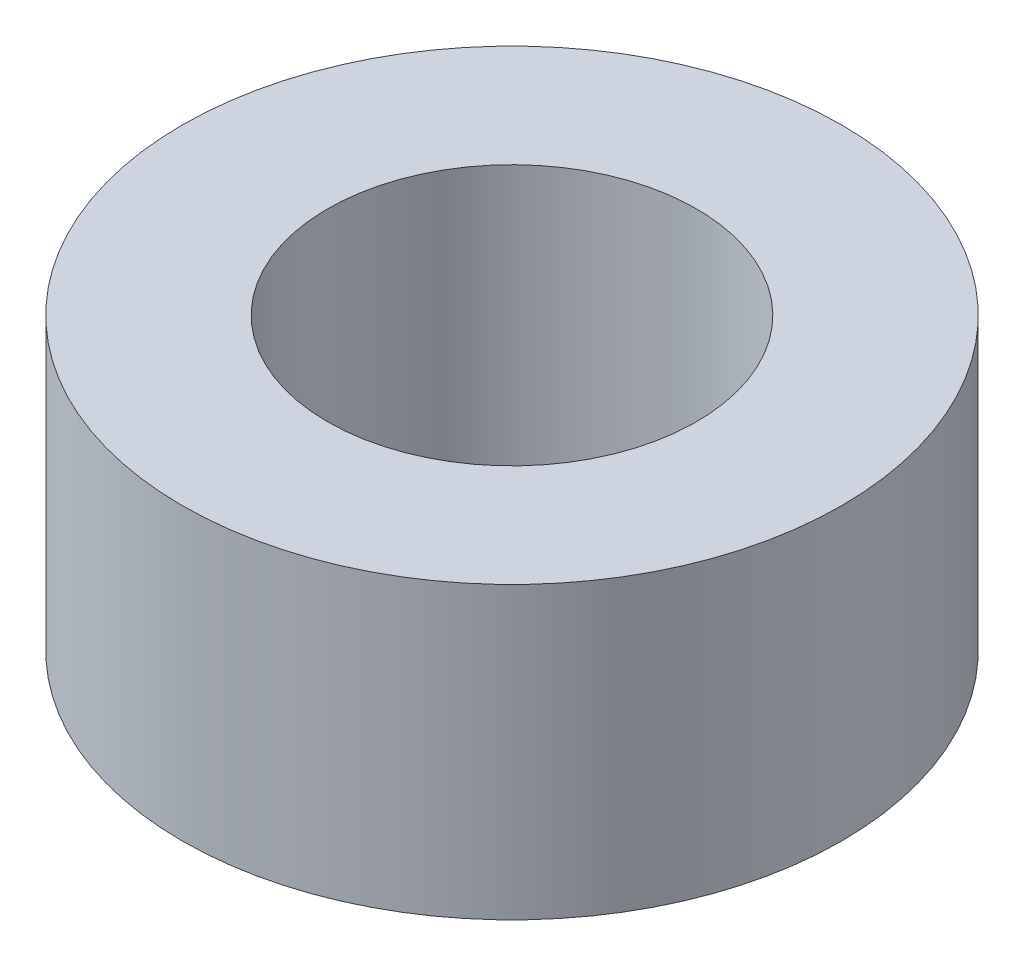
ISO-10303-21;
HEADER;
FILE_DESCRIPTION(('STEP AP214'),'2;1');
FILE_NAME('part.step','',(''),(''),'','','');
FILE_SCHEMA(('AUTOMOTIVE_DESIGN { 1 0 10303 214 1 1 1 1 }'));
ENDSEC;
DATA;
#1=APPLICATION_CONTEXT('core data for automotive mechanical design processes');
#2=APPLICATION_PROTOCOL_DEFINITION('international standard','automotive_design',2000,#1);
#3=PRODUCT_CONTEXT('',#1,'mechanical');
#4=PRODUCT('Part','Part','',(#3));
#5=PRODUCT_RELATED_PRODUCT_CATEGORY('part','',(#4));
#6=PRODUCT_DEFINITION_FORMATION('','',#4);
#7=PRODUCT_DEFINITION_CONTEXT('part definition',#1,'design');
#8=PRODUCT_DEFINITION('design','',#6,#7);
#9=PRODUCT_DEFINITION_SHAPE('','',#8);
#10=(LENGTH_UNIT() NAMED_UNIT(*) SI_UNIT(.MILLI.,.METRE.));
#11=(NAMED_UNIT(*) PLANE_ANGLE_UNIT() SI_UNIT($,.RADIAN.));
#12=(NAMED_UNIT(*) SI_UNIT($,.STERADIAN.) SOLID_ANGLE_UNIT());
#13=UNCERTAINTY_MEASURE_WITH_UNIT(LENGTH_MEASURE(1.E-05),#10,'distance_accuracy_value','');
#14=(GEOMETRIC_REPRESENTATION_CONTEXT(3) GLOBAL_UNCERTAINTY_ASSIGNED_CONTEXT((#13)) GLOBAL_UNIT_ASSIGNED_CONTEXT((#10,
#11,#12)) REPRESENTATION_CONTEXT('',''));
#15=CARTESIAN_POINT('',(0.,0.,0.));
#16=DIRECTION('',(0.,0.,1.));
#17=DIRECTION('',(1.,0.,0.));
#18=AXIS2_PLACEMENT_3D('',#15,#16,#17);
#19=CARTESIAN_POINT('',(0.,10.,0.));
#20=DIRECTION('',(0.,1.,0.));
#21=DIRECTION('',(0.,0.,1.));
#22=AXIS2_PLACEMENT_3D('',#19,#20,#21);
#23=PLANE('',#22);
#24=CARTESIAN_POINT('',(0.,10.,0.));
#25=DIRECTION('',(0.,1.,0.));
#26=DIRECTION('',(0.,0.,1.));
#27=AXIS2_PLACEMENT_3D('',#24,#25,#26);
#28=CIRCLE('',#27,11.35);
#29=CARTESIAN_POINT('',(0.,10.,11.35));
#30=VERTEX_POINT('',#29);
#31=EDGE_CURVE('E10',#30,#30,#28,.T.);
#32=ORIENTED_EDGE('',*,*,#31,.T.);
#33=EDGE_LOOP('',(#32));
#34=FACE_BOUND('',#33,.T.);
#35=CARTESIAN_POINT('',(0.,10.,0.));
#36=DIRECTION('',(0.,1.,0.));
#37=DIRECTION('',(0.,0.,1.));
#38=AXIS2_PLACEMENT_3D('',#35,#36,#37);
#39=CIRCLE('',#38,6.35);
#40=CARTESIAN_POINT('',(0.,10.,6.35));
#41=VERTEX_POINT('',#40);
#42=EDGE_CURVE('E42',#41,#41,#39,.T.);
#43=ORIENTED_EDGE('',*,*,#42,.F.);
#44=EDGE_LOOP('',(#43));
#45=FACE_BOUND('',#44,.T.);
#46=ADVANCED_FACE('F31',(#34,#45),#23,.T.);
#47=CARTESIAN_POINT('',(0.,0.,0.));
#48=DIRECTION('',(0.,1.,0.));
#49=DIRECTION('',(0.,0.,1.));
#50=AXIS2_PLACEMENT_3D('',#47,#48,#49);
#51=PLANE('',#50);
#52=CARTESIAN_POINT('',(0.,0.,0.));
#53=DIRECTION('',(0.,1.,0.));
#54=DIRECTION('',(0.,0.,1.));
#55=AXIS2_PLACEMENT_3D('',#52,#53,#54);
#56=CIRCLE('',#55,11.35);
#57=CARTESIAN_POINT('',(0.,0.,11.35));
#58=VERTEX_POINT('',#57);
#59=EDGE_CURVE('E35',#58,#58,#56,.T.);
#60=ORIENTED_EDGE('',*,*,#59,.F.);
#61=EDGE_LOOP('',(#60));
#62=FACE_BOUND('',#61,.T.);
#63=CARTESIAN_POINT('',(0.,0.,0.));
#64=DIRECTION('',(0.,1.,0.));
#65=DIRECTION('',(0.,0.,1.));
#66=AXIS2_PLACEMENT_3D('',#63,#64,#65);
#67=CIRCLE('',#66,6.35);
#68=CARTESIAN_POINT('',(0.,0.,6.35));
#69=VERTEX_POINT('',#68);
#70=EDGE_CURVE('E44',#69,#69,#67,.T.);
#71=ORIENTED_EDGE('',*,*,#70,.T.);
#72=EDGE_LOOP('',(#71));
#73=FACE_BOUND('',#72,.T.);
#74=ADVANCED_FACE('F54',(#62,#73),#51,.F.);
#75=CARTESIAN_POINT('',(0.,10.,0.));
#76=DIRECTION('',(0.,-1.,0.));
#77=DIRECTION('',(0.,0.,-1.));
#78=AXIS2_PLACEMENT_3D('',#75,#76,#77);
#79=CYLINDRICAL_SURFACE('',#78,11.35);
#80=ORIENTED_EDGE('',*,*,#31,.F.);
#81=EDGE_LOOP('',(#80));
#82=FACE_BOUND('',#81,.T.);
#83=ORIENTED_EDGE('',*,*,#59,.T.);
#84=EDGE_LOOP('',(#83));
#85=FACE_BOUND('',#84,.T.);
#86=ADVANCED_FACE('F33',(#82,#85),#79,.T.);
#87=CARTESIAN_POINT('',(0.,10.,0.));
#88=DIRECTION('',(0.,-1.,0.));
#89=DIRECTION('',(0.,0.,-1.));
#90=AXIS2_PLACEMENT_3D('',#87,#88,#89);
#91=CYLINDRICAL_SURFACE('',#90,6.35);
#92=ORIENTED_EDGE('',*,*,#42,.T.);
#93=EDGE_LOOP('',(#92));
#94=FACE_BOUND('',#93,.T.);
#95=ORIENTED_EDGE('',*,*,#70,.F.);
#96=EDGE_LOOP('',(#95));
#97=FACE_BOUND('',#96,.T.);
#98=ADVANCED_FACE('F50',(#94,#97),#91,.F.);
#99=CLOSED_SHELL('',(#46,#74,#86,#98));
#100=MANIFOLD_SOLID_BREP('B2',#99);
#101=ADVANCED_BREP_SHAPE_REPRESENTATION('',(#18,#100),#14);
#102=SHAPE_DEFINITION_REPRESENTATION(#9,#101);
ENDSEC;
END-ISO-10303-21;
